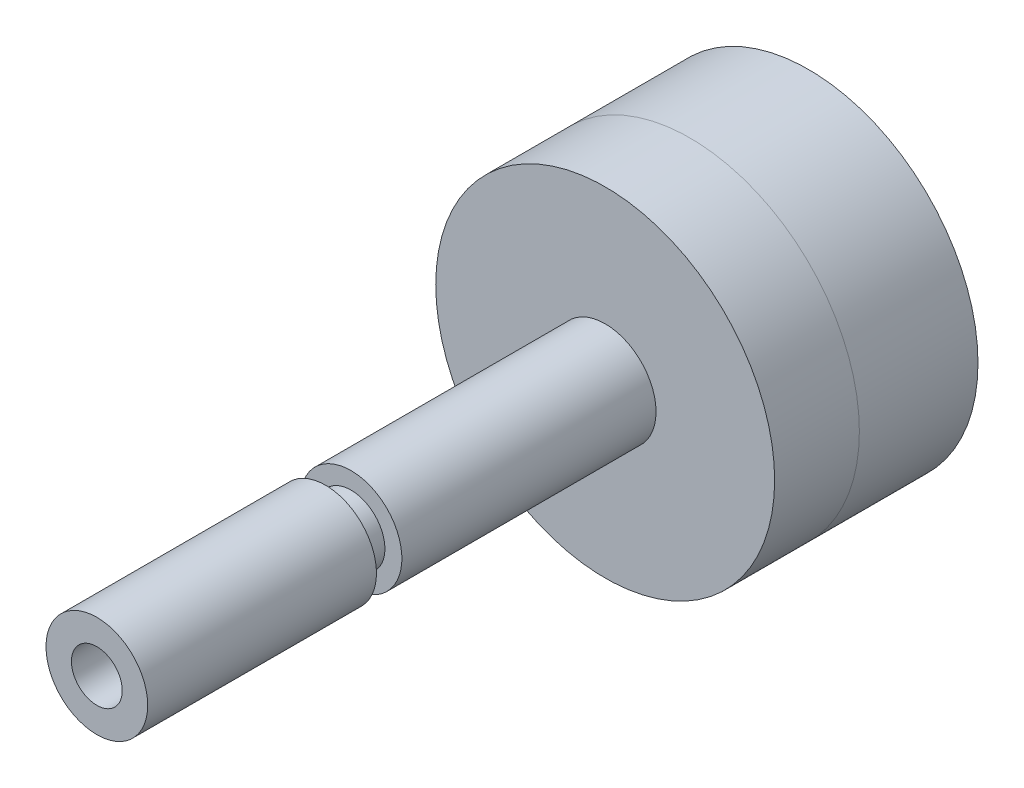
ISO-10303-21;
HEADER;
FILE_DESCRIPTION(('STEP AP214'),'2;1');
FILE_NAME('part.step','',(''),(''),'','','');
FILE_SCHEMA(('AUTOMOTIVE_DESIGN { 1 0 10303 214 1 1 1 1 }'));
ENDSEC;
DATA;
#1=APPLICATION_CONTEXT('core data for automotive mechanical design processes');
#2=APPLICATION_PROTOCOL_DEFINITION('international standard','automotive_design',2000,#1);
#3=PRODUCT_CONTEXT('',#1,'mechanical');
#4=PRODUCT('Part','Part','',(#3));
#5=PRODUCT_RELATED_PRODUCT_CATEGORY('part','',(#4));
#6=PRODUCT_DEFINITION_FORMATION('','',#4);
#7=PRODUCT_DEFINITION_CONTEXT('part definition',#1,'design');
#8=PRODUCT_DEFINITION('design','',#6,#7);
#9=PRODUCT_DEFINITION_SHAPE('','',#8);
#10=(LENGTH_UNIT() NAMED_UNIT(*) SI_UNIT(.MILLI.,.METRE.));
#11=(NAMED_UNIT(*) PLANE_ANGLE_UNIT() SI_UNIT($,.RADIAN.));
#12=(NAMED_UNIT(*) SI_UNIT($,.STERADIAN.) SOLID_ANGLE_UNIT());
#13=UNCERTAINTY_MEASURE_WITH_UNIT(LENGTH_MEASURE(1.E-05),#10,'distance_accuracy_value','');
#14=(GEOMETRIC_REPRESENTATION_CONTEXT(3) GLOBAL_UNCERTAINTY_ASSIGNED_CONTEXT((#13)) GLOBAL_UNIT_ASSIGNED_CONTEXT((#10,
#11,#12)) REPRESENTATION_CONTEXT('',''));
#15=CARTESIAN_POINT('',(0.,0.,0.));
#16=DIRECTION('',(0.,0.,1.));
#17=DIRECTION('',(1.,0.,0.));
#18=AXIS2_PLACEMENT_3D('',#15,#16,#17);
#19=CARTESIAN_POINT('',(0.,0.,-7.));
#20=DIRECTION('',(0.,0.,1.));
#21=DIRECTION('',(1.,0.,0.));
#22=AXIS2_PLACEMENT_3D('',#19,#20,#21);
#23=CYLINDRICAL_SURFACE('',#22,10.);
#24=CARTESIAN_POINT('',(0.,0.,-7.));
#25=DIRECTION('',(0.,0.,1.));
#26=DIRECTION('',(1.,0.,0.));
#27=AXIS2_PLACEMENT_3D('',#24,#25,#26);
#28=CIRCLE('',#27,10.);
#29=CARTESIAN_POINT('',(10.,0.,-7.));
#30=VERTEX_POINT('',#29);
#31=EDGE_CURVE('E12',#30,#30,#28,.T.);
#32=ORIENTED_EDGE('',*,*,#31,.T.);
#33=EDGE_LOOP('',(#32));
#34=FACE_BOUND('',#33,.T.);
#35=CARTESIAN_POINT('',(0.,0.,0.));
#36=DIRECTION('',(0.,0.,1.));
#37=DIRECTION('',(1.,0.,0.));
#38=AXIS2_PLACEMENT_3D('',#35,#36,#37);
#39=CIRCLE('',#38,10.);
#40=CARTESIAN_POINT('',(10.,0.,0.));
#41=VERTEX_POINT('',#40);
#42=EDGE_CURVE('E59',#41,#41,#39,.T.);
#43=ORIENTED_EDGE('',*,*,#42,.F.);
#44=EDGE_LOOP('',(#43));
#45=FACE_BOUND('',#44,.T.);
#46=ADVANCED_FACE('F56',(#34,#45),#23,.T.);
#47=CARTESIAN_POINT('',(0.,0.,-7.));
#48=DIRECTION('',(0.,0.,1.));
#49=DIRECTION('',(1.,0.,0.));
#50=AXIS2_PLACEMENT_3D('',#47,#48,#49);
#51=PLANE('',#50);
#52=CARTESIAN_POINT('',(0.,0.,-7.));
#53=DIRECTION('',(0.,0.,1.));
#54=DIRECTION('',(1.,0.,0.));
#55=AXIS2_PLACEMENT_3D('',#52,#53,#54);
#56=CIRCLE('',#55,9.);
#57=CARTESIAN_POINT('',(9.,0.,-7.));
#58=VERTEX_POINT('',#57);
#59=EDGE_CURVE('E66',#58,#58,#56,.T.);
#60=ORIENTED_EDGE('',*,*,#59,.T.);
#61=EDGE_LOOP('',(#60));
#62=FACE_BOUND('',#61,.T.);
#63=ORIENTED_EDGE('',*,*,#31,.F.);
#64=EDGE_LOOP('',(#63));
#65=FACE_BOUND('',#64,.T.);
#66=ADVANCED_FACE('F74',(#62,#65),#51,.F.);
#67=CARTESIAN_POINT('',(0.,0.,0.));
#68=DIRECTION('',(0.,0.,1.));
#69=DIRECTION('',(1.,0.,0.));
#70=AXIS2_PLACEMENT_3D('',#67,#68,#69);
#71=PLANE('',#70);
#72=CARTESIAN_POINT('',(0.,0.,0.));
#73=DIRECTION('',(0.,0.,1.));
#74=DIRECTION('',(1.,0.,0.));
#75=AXIS2_PLACEMENT_3D('',#72,#73,#74);
#76=CIRCLE('',#75,9.);
#77=CARTESIAN_POINT('',(9.,0.,0.));
#78=VERTEX_POINT('',#77);
#79=EDGE_CURVE('E68',#78,#78,#76,.T.);
#80=ORIENTED_EDGE('',*,*,#79,.F.);
#81=EDGE_LOOP('',(#80));
#82=FACE_BOUND('',#81,.T.);
#83=ORIENTED_EDGE('',*,*,#42,.T.);
#84=EDGE_LOOP('',(#83));
#85=FACE_BOUND('',#84,.T.);
#86=ADVANCED_FACE('F80',(#82,#85),#71,.T.);
#87=CARTESIAN_POINT('',(0.,0.,-7.));
#88=DIRECTION('',(0.,0.,1.));
#89=DIRECTION('',(1.,0.,0.));
#90=AXIS2_PLACEMENT_3D('',#87,#88,#89);
#91=CYLINDRICAL_SURFACE('',#90,9.);
#92=ORIENTED_EDGE('',*,*,#59,.F.);
#93=EDGE_LOOP('',(#92));
#94=FACE_BOUND('',#93,.T.);
#95=ORIENTED_EDGE('',*,*,#79,.T.);
#96=EDGE_LOOP('',(#95));
#97=FACE_BOUND('',#96,.T.);
#98=ADVANCED_FACE('F77',(#94,#97),#91,.F.);
#99=CLOSED_SHELL('',(#46,#66,#86,#98));
#100=MANIFOLD_SOLID_BREP('B2',#99);
#101=CARTESIAN_POINT('',(0.,0.,35.));
#102=DIRECTION('',(0.,0.,-1.));
#103=DIRECTION('',(-1.,0.,0.));
#104=AXIS2_PLACEMENT_3D('',#101,#102,#103);
#105=CYLINDRICAL_SURFACE('',#104,3.);
#106=CARTESIAN_POINT('',(0.,0.,20.));
#107=DIRECTION('',(0.,0.,-1.));
#108=DIRECTION('',(-1.,0.,0.));
#109=AXIS2_PLACEMENT_3D('',#106,#107,#108);
#110=CIRCLE('',#109,3.);
#111=CARTESIAN_POINT('',(-3.,0.,20.));
#112=VERTEX_POINT('',#111);
#113=EDGE_CURVE('E152',#112,#112,#110,.T.);
#114=ORIENTED_EDGE('',*,*,#113,.T.);
#115=EDGE_LOOP('',(#114));
#116=FACE_BOUND('',#115,.T.);
#117=CARTESIAN_POINT('',(0.,0.,5.));
#118=DIRECTION('',(0.,0.,1.));
#119=DIRECTION('',(1.,0.,0.));
#120=AXIS2_PLACEMENT_3D('',#117,#118,#119);
#121=CIRCLE('',#120,3.);
#122=CARTESIAN_POINT('',(3.,0.,5.));
#123=VERTEX_POINT('',#122);
#124=EDGE_CURVE('E142',#123,#123,#121,.F.);
#125=ORIENTED_EDGE('',*,*,#124,.F.);
#126=EDGE_LOOP('',(#125));
#127=FACE_BOUND('',#126,.T.);
#128=ADVANCED_FACE('F125',(#116,#127),#105,.T.);
#129=CARTESIAN_POINT('',(0.,0.,5.));
#130=DIRECTION('',(0.,0.,-1.));
#131=DIRECTION('',(-1.,0.,0.));
#132=AXIS2_PLACEMENT_3D('',#129,#130,#131);
#133=CYLINDRICAL_SURFACE('',#132,10.);
#134=CARTESIAN_POINT('',(0.,0.,5.));
#135=DIRECTION('',(0.,0.,1.));
#136=DIRECTION('',(1.,0.,0.));
#137=AXIS2_PLACEMENT_3D('',#134,#135,#136);
#138=CIRCLE('',#137,10.);
#139=CARTESIAN_POINT('',(10.,0.,5.));
#140=VERTEX_POINT('',#139);
#141=EDGE_CURVE('E133',#140,#140,#138,.T.);
#142=ORIENTED_EDGE('',*,*,#141,.F.);
#143=EDGE_LOOP('',(#142));
#144=FACE_BOUND('',#143,.T.);
#145=CARTESIAN_POINT('',(0.,0.,0.));
#146=DIRECTION('',(0.,0.,1.));
#147=DIRECTION('',(1.,0.,0.));
#148=AXIS2_PLACEMENT_3D('',#145,#146,#147);
#149=CIRCLE('',#148,10.);
#150=CARTESIAN_POINT('',(10.,0.,0.));
#151=VERTEX_POINT('',#150);
#152=EDGE_CURVE('E129',#151,#151,#149,.T.);
#153=ORIENTED_EDGE('',*,*,#152,.T.);
#154=EDGE_LOOP('',(#153));
#155=FACE_BOUND('',#154,.T.);
#156=ADVANCED_FACE('F127',(#144,#155),#133,.T.);
#157=CARTESIAN_POINT('',(0.,0.,5.));
#158=DIRECTION('',(0.,0.,1.));
#159=DIRECTION('',(1.,0.,0.));
#160=AXIS2_PLACEMENT_3D('',#157,#158,#159);
#161=PLANE('',#160);
#162=ORIENTED_EDGE('',*,*,#124,.T.);
#163=EDGE_LOOP('',(#162));
#164=FACE_BOUND('',#163,.T.);
#165=ORIENTED_EDGE('',*,*,#141,.T.);
#166=EDGE_LOOP('',(#165));
#167=FACE_BOUND('',#166,.T.);
#168=ADVANCED_FACE('F186',(#164,#167),#161,.T.);
#169=CARTESIAN_POINT('',(0.,0.,0.));
#170=DIRECTION('',(0.,0.,1.));
#171=DIRECTION('',(1.,0.,0.));
#172=AXIS2_PLACEMENT_3D('',#169,#170,#171);
#173=PLANE('',#172);
#174=ORIENTED_EDGE('',*,*,#152,.F.);
#175=EDGE_LOOP('',(#174));
#176=FACE_BOUND('',#175,.T.);
#177=ADVANCED_FACE('F195',(#176),#173,.F.);
#178=CARTESIAN_POINT('',(-3.,0.,20.));
#179=DIRECTION('',(0.,0.,-1.));
#180=DIRECTION('',(-1.,0.,0.));
#181=AXIS2_PLACEMENT_3D('',#178,#179,#180);
#182=PLANE('',#181);
#183=ORIENTED_EDGE('',*,*,#113,.F.);
#184=EDGE_LOOP('',(#183));
#185=FACE_BOUND('',#184,.T.);
#186=CARTESIAN_POINT('',(0.,0.,20.));
#187=DIRECTION('',(0.,0.,-1.));
#188=DIRECTION('',(-1.,0.,0.));
#189=AXIS2_PLACEMENT_3D('',#186,#187,#188);
#190=CIRCLE('',#189,2.);
#191=CARTESIAN_POINT('',(-2.,0.,20.));
#192=VERTEX_POINT('',#191);
#193=EDGE_CURVE('E156',#192,#192,#190,.T.);
#194=ORIENTED_EDGE('',*,*,#193,.T.);
#195=EDGE_LOOP('',(#194));
#196=FACE_BOUND('',#195,.T.);
#197=ADVANCED_FACE('F191',(#185,#196),#182,.F.);
#198=CARTESIAN_POINT('',(0.,0.,0.));
#199=DIRECTION('',(0.,0.,-1.));
#200=DIRECTION('',(-1.,0.,0.));
#201=AXIS2_PLACEMENT_3D('',#198,#199,#200);
#202=CYLINDRICAL_SURFACE('',#201,2.);
#203=ORIENTED_EDGE('',*,*,#193,.F.);
#204=EDGE_LOOP('',(#203));
#205=FACE_BOUND('',#204,.T.);
#206=CARTESIAN_POINT('',(0.,0.,21.5));
#207=DIRECTION('',(0.,0.,-1.));
#208=DIRECTION('',(-1.,0.,0.));
#209=AXIS2_PLACEMENT_3D('',#206,#207,#208);
#210=CIRCLE('',#209,2.);
#211=CARTESIAN_POINT('',(-2.,0.,21.5));
#212=VERTEX_POINT('',#211);
#213=EDGE_CURVE('E161',#212,#212,#210,.T.);
#214=ORIENTED_EDGE('',*,*,#213,.T.);
#215=EDGE_LOOP('',(#214));
#216=FACE_BOUND('',#215,.T.);
#217=ADVANCED_FACE('F194',(#205,#216),#202,.T.);
#218=CARTESIAN_POINT('',(-3.,0.,21.5));
#219=DIRECTION('',(0.,0.,1.));
#220=DIRECTION('',(1.,0.,0.));
#221=AXIS2_PLACEMENT_3D('',#218,#219,#220);
#222=PLANE('',#221);
#223=ORIENTED_EDGE('',*,*,#213,.F.);
#224=EDGE_LOOP('',(#223));
#225=FACE_BOUND('',#224,.T.);
#226=CARTESIAN_POINT('',(0.,0.,21.5));
#227=DIRECTION('',(0.,0.,-1.));
#228=DIRECTION('',(-1.,0.,0.));
#229=AXIS2_PLACEMENT_3D('',#226,#227,#228);
#230=CIRCLE('',#229,3.);
#231=CARTESIAN_POINT('',(-3.,0.,21.5));
#232=VERTEX_POINT('',#231);
#233=EDGE_CURVE('E164',#232,#232,#230,.T.);
#234=ORIENTED_EDGE('',*,*,#233,.T.);
#235=EDGE_LOOP('',(#234));
#236=FACE_BOUND('',#235,.T.);
#237=ADVANCED_FACE('F168',(#225,#236),#222,.F.);
#238=CARTESIAN_POINT('',(0.,0.,5.));
#239=DIRECTION('',(0.,0.,1.));
#240=DIRECTION('',(1.,0.,0.));
#241=AXIS2_PLACEMENT_3D('',#238,#239,#240);
#242=CIRCLE('',#241,1.5);
#243=CARTESIAN_POINT('',(1.5,0.,5.));
#244=VERTEX_POINT('',#243);
#245=EDGE_CURVE('E55',#244,#244,#242,.F.);
#246=ORIENTED_EDGE('',*,*,#245,.F.);
#247=EDGE_LOOP('',(#246));
#248=FACE_BOUND('',#247,.T.);
#249=ADVANCED_FACE('F205',(#248),#161,.T.);
#250=CARTESIAN_POINT('',(0.,0.,35.));
#251=DIRECTION('',(0.,0.,-1.));
#252=DIRECTION('',(-1.,0.,0.));
#253=AXIS2_PLACEMENT_3D('',#250,#251,#252);
#254=CYLINDRICAL_SURFACE('',#253,1.5);
#255=ORIENTED_EDGE('',*,*,#245,.T.);
#256=EDGE_LOOP('',(#255));
#257=FACE_BOUND('',#256,.T.);
#258=CARTESIAN_POINT('',(0.,0.,35.));
#259=DIRECTION('',(0.,0.,1.));
#260=DIRECTION('',(1.,0.,0.));
#261=AXIS2_PLACEMENT_3D('',#258,#259,#260);
#262=CIRCLE('',#261,1.5);
#263=CARTESIAN_POINT('',(1.5,0.,35.));
#264=VERTEX_POINT('',#263);
#265=EDGE_CURVE('E148',#264,#264,#262,.T.);
#266=ORIENTED_EDGE('',*,*,#265,.T.);
#267=EDGE_LOOP('',(#266));
#268=FACE_BOUND('',#267,.T.);
#269=ADVANCED_FACE('F178',(#257,#268),#254,.F.);
#270=CARTESIAN_POINT('',(0.,0.,35.));
#271=DIRECTION('',(0.,0.,1.));
#272=DIRECTION('',(1.,0.,0.));
#273=AXIS2_PLACEMENT_3D('',#270,#271,#272);
#274=PLANE('',#273);
#275=CARTESIAN_POINT('',(0.,0.,35.));
#276=DIRECTION('',(0.,0.,1.));
#277=DIRECTION('',(1.,0.,0.));
#278=AXIS2_PLACEMENT_3D('',#275,#276,#277);
#279=CIRCLE('',#278,3.);
#280=CARTESIAN_POINT('',(3.,0.,35.));
#281=VERTEX_POINT('',#280);
#282=EDGE_CURVE('E140',#281,#281,#279,.T.);
#283=ORIENTED_EDGE('',*,*,#282,.T.);
#284=EDGE_LOOP('',(#283));
#285=FACE_BOUND('',#284,.T.);
#286=ORIENTED_EDGE('',*,*,#265,.F.);
#287=EDGE_LOOP('',(#286));
#288=FACE_BOUND('',#287,.T.);
#289=ADVANCED_FACE('F173',(#285,#288),#274,.T.);
#290=ORIENTED_EDGE('',*,*,#233,.F.);
#291=EDGE_LOOP('',(#290));
#292=FACE_BOUND('',#291,.T.);
#293=ORIENTED_EDGE('',*,*,#282,.F.);
#294=EDGE_LOOP('',(#293));
#295=FACE_BOUND('',#294,.T.);
#296=ADVANCED_FACE('F170',(#292,#295),#105,.T.);
#297=CLOSED_SHELL('',(#128,#156,#168,#177,#197,#217,#237,#249,#269,#289,#296));
#298=MANIFOLD_SOLID_BREP('B7',#297);
#299=ADVANCED_BREP_SHAPE_REPRESENTATION('',(#18,#100,#298),#14);
#300=SHAPE_DEFINITION_REPRESENTATION(#9,#299);
ENDSEC;
END-ISO-10303-21;
